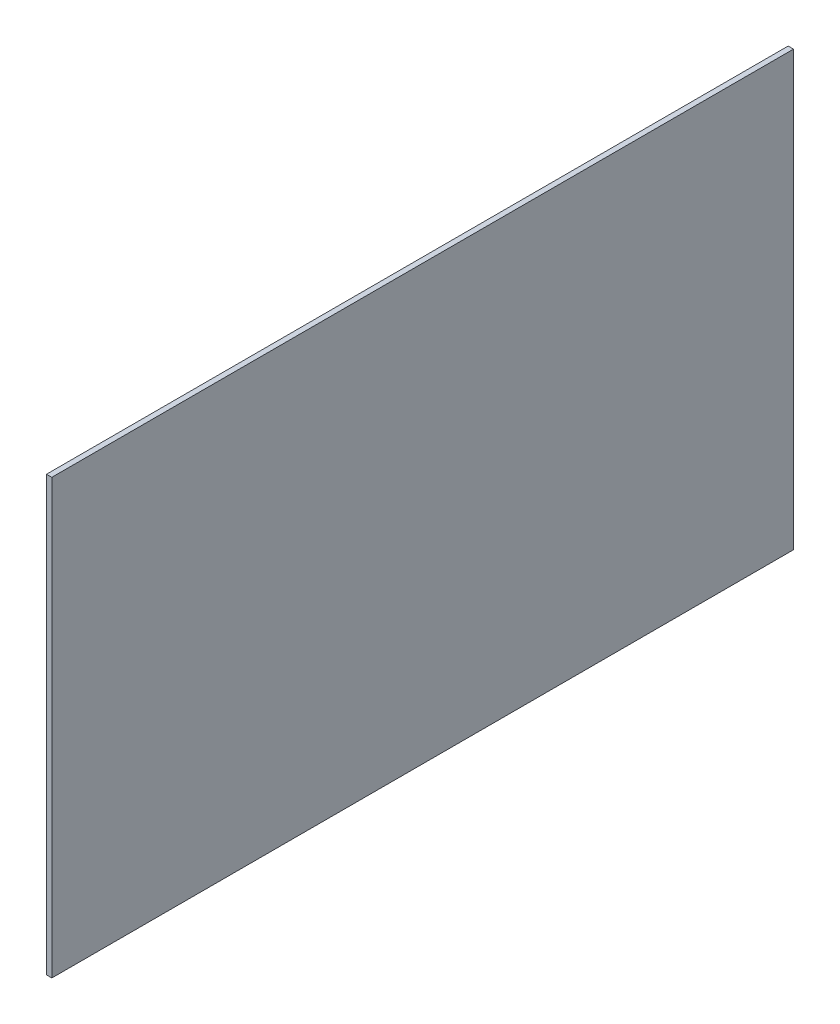
ISO-10303-21;
HEADER;
FILE_DESCRIPTION(('STEP AP214'),'2;1');
FILE_NAME('part.step','',(''),(''),'','','');
FILE_SCHEMA(('AUTOMOTIVE_DESIGN { 1 0 10303 214 1 1 1 1 }'));
ENDSEC;
DATA;
#1=APPLICATION_CONTEXT('core data for automotive mechanical design processes');
#2=APPLICATION_PROTOCOL_DEFINITION('international standard','automotive_design',2000,#1);
#3=PRODUCT_CONTEXT('',#1,'mechanical');
#4=PRODUCT('Part','Part','',(#3));
#5=PRODUCT_RELATED_PRODUCT_CATEGORY('part','',(#4));
#6=PRODUCT_DEFINITION_FORMATION('','',#4);
#7=PRODUCT_DEFINITION_CONTEXT('part definition',#1,'design');
#8=PRODUCT_DEFINITION('design','',#6,#7);
#9=PRODUCT_DEFINITION_SHAPE('','',#8);
#10=(LENGTH_UNIT() NAMED_UNIT(*) SI_UNIT(.MILLI.,.METRE.));
#11=(NAMED_UNIT(*) PLANE_ANGLE_UNIT() SI_UNIT($,.RADIAN.));
#12=(NAMED_UNIT(*) SI_UNIT($,.STERADIAN.) SOLID_ANGLE_UNIT());
#13=UNCERTAINTY_MEASURE_WITH_UNIT(LENGTH_MEASURE(1.E-05),#10,'distance_accuracy_value','');
#14=(GEOMETRIC_REPRESENTATION_CONTEXT(3) GLOBAL_UNCERTAINTY_ASSIGNED_CONTEXT((#13)) GLOBAL_UNIT_ASSIGNED_CONTEXT((#10,
#11,#12)) REPRESENTATION_CONTEXT('',''));
#15=CARTESIAN_POINT('',(0.,0.,0.));
#16=DIRECTION('',(0.,0.,1.));
#17=DIRECTION('',(1.,0.,0.));
#18=AXIS2_PLACEMENT_3D('',#15,#16,#17);
#19=CARTESIAN_POINT('',(16.,1299.,0.));
#20=DIRECTION('',(0.,0.,1.));
#21=DIRECTION('',(0.,-1.,0.));
#22=AXIS2_PLACEMENT_3D('',#19,#20,#21);
#23=PLANE('',#22);
#24=DIRECTION('',(0.,1.,0.));
#25=VECTOR('',#24,1.);
#26=CARTESIAN_POINT('',(0.,1299.,0.));
#27=LINE('',#26,#25);
#28=CARTESIAN_POINT('',(0.,0.,0.));
#29=VERTEX_POINT('',#28);
#30=CARTESIAN_POINT('',(0.,1299.,0.));
#31=VERTEX_POINT('',#30);
#32=EDGE_CURVE('E98',#29,#31,#27,.T.);
#33=ORIENTED_EDGE('',*,*,#32,.T.);
#34=DIRECTION('',(-1.,0.,0.));
#35=VECTOR('',#34,1.);
#36=CARTESIAN_POINT('',(16.,1299.,0.));
#37=LINE('',#36,#35);
#38=CARTESIAN_POINT('',(16.,1299.,0.));
#39=VERTEX_POINT('',#38);
#40=EDGE_CURVE('E11',#39,#31,#37,.T.);
#41=ORIENTED_EDGE('',*,*,#40,.F.);
#42=DIRECTION('',(0.,1.,0.));
#43=VECTOR('',#42,1.);
#44=CARTESIAN_POINT('',(16.,1299.,0.));
#45=LINE('',#44,#43);
#46=CARTESIAN_POINT('',(16.,0.,0.));
#47=VERTEX_POINT('',#46);
#48=EDGE_CURVE('E86',#47,#39,#45,.T.);
#49=ORIENTED_EDGE('',*,*,#48,.F.);
#50=DIRECTION('',(-1.,0.,0.));
#51=VECTOR('',#50,1.);
#52=CARTESIAN_POINT('',(16.,0.,0.));
#53=LINE('',#52,#51);
#54=EDGE_CURVE('E94',#47,#29,#53,.T.);
#55=ORIENTED_EDGE('',*,*,#54,.T.);
#56=EDGE_LOOP('',(#33,#41,#49,#55));
#57=FACE_BOUND('',#56,.T.);
#58=ADVANCED_FACE('F35',(#57),#23,.F.);
#59=CARTESIAN_POINT('',(16.,1299.,0.));
#60=DIRECTION('',(0.,-1.,0.));
#61=DIRECTION('',(0.,0.,-1.));
#62=AXIS2_PLACEMENT_3D('',#59,#60,#61);
#63=PLANE('',#62);
#64=DIRECTION('',(0.,0.,1.));
#65=VECTOR('',#64,1.);
#66=CARTESIAN_POINT('',(0.,1299.,0.));
#67=LINE('',#66,#65);
#68=CARTESIAN_POINT('',(0.,1299.,2222.));
#69=VERTEX_POINT('',#68);
#70=EDGE_CURVE('E90',#31,#69,#67,.T.);
#71=ORIENTED_EDGE('',*,*,#70,.T.);
#72=DIRECTION('',(-1.,0.,0.));
#73=VECTOR('',#72,1.);
#74=CARTESIAN_POINT('',(16.,1299.,2222.));
#75=LINE('',#74,#73);
#76=CARTESIAN_POINT('',(16.,1299.,2222.));
#77=VERTEX_POINT('',#76);
#78=EDGE_CURVE('E43',#77,#69,#75,.T.);
#79=ORIENTED_EDGE('',*,*,#78,.F.);
#80=DIRECTION('',(0.,0.,1.));
#81=VECTOR('',#80,1.);
#82=CARTESIAN_POINT('',(16.,1299.,0.));
#83=LINE('',#82,#81);
#84=EDGE_CURVE('E81',#39,#77,#83,.T.);
#85=ORIENTED_EDGE('',*,*,#84,.F.);
#86=ORIENTED_EDGE('',*,*,#40,.T.);
#87=EDGE_LOOP('',(#71,#79,#85,#86));
#88=FACE_BOUND('',#87,.T.);
#89=ADVANCED_FACE('F89',(#88),#63,.F.);
#90=CARTESIAN_POINT('',(16.,1299.,2222.));
#91=DIRECTION('',(0.,0.,-1.));
#92=DIRECTION('',(0.,1.,0.));
#93=AXIS2_PLACEMENT_3D('',#90,#91,#92);
#94=PLANE('',#93);
#95=DIRECTION('',(0.,-1.,0.));
#96=VECTOR('',#95,1.);
#97=CARTESIAN_POINT('',(0.,1299.,2222.));
#98=LINE('',#97,#96);
#99=CARTESIAN_POINT('',(0.,-2.3121331567902E-13,2222.));
#100=VERTEX_POINT('',#99);
#101=EDGE_CURVE('E68',#69,#100,#98,.T.);
#102=ORIENTED_EDGE('',*,*,#101,.T.);
#103=DIRECTION('',(-1.,0.,0.));
#104=VECTOR('',#103,1.);
#105=CARTESIAN_POINT('',(16.,-2.3121331567902E-13,2222.));
#106=LINE('',#105,#104);
#107=CARTESIAN_POINT('',(16.,-2.3121331567902E-13,2222.));
#108=VERTEX_POINT('',#107);
#109=EDGE_CURVE('E91',#108,#100,#106,.T.);
#110=ORIENTED_EDGE('',*,*,#109,.F.);
#111=DIRECTION('',(0.,-1.,0.));
#112=VECTOR('',#111,1.);
#113=CARTESIAN_POINT('',(16.,1299.,2222.));
#114=LINE('',#113,#112);
#115=EDGE_CURVE('E84',#77,#108,#114,.T.);
#116=ORIENTED_EDGE('',*,*,#115,.F.);
#117=ORIENTED_EDGE('',*,*,#78,.T.);
#118=EDGE_LOOP('',(#102,#110,#116,#117));
#119=FACE_BOUND('',#118,.T.);
#120=ADVANCED_FACE('F92',(#119),#94,.F.);
#121=CARTESIAN_POINT('',(16.,0.,0.));
#122=DIRECTION('',(0.,1.,0.));
#123=DIRECTION('',(0.,0.,1.));
#124=AXIS2_PLACEMENT_3D('',#121,#122,#123);
#125=PLANE('',#124);
#126=DIRECTION('',(0.,0.,-1.));
#127=VECTOR('',#126,1.);
#128=CARTESIAN_POINT('',(0.,0.,0.));
#129=LINE('',#128,#127);
#130=EDGE_CURVE('E74',#100,#29,#129,.T.);
#131=ORIENTED_EDGE('',*,*,#130,.T.);
#132=ORIENTED_EDGE('',*,*,#54,.F.);
#133=DIRECTION('',(0.,0.,-1.));
#134=VECTOR('',#133,1.);
#135=CARTESIAN_POINT('',(16.,0.,0.));
#136=LINE('',#135,#134);
#137=EDGE_CURVE('E51',#108,#47,#136,.T.);
#138=ORIENTED_EDGE('',*,*,#137,.F.);
#139=ORIENTED_EDGE('',*,*,#109,.T.);
#140=EDGE_LOOP('',(#131,#132,#138,#139));
#141=FACE_BOUND('',#140,.T.);
#142=ADVANCED_FACE('F105',(#141),#125,.F.);
#143=CARTESIAN_POINT('',(16.,0.,0.));
#144=DIRECTION('',(-1.,0.,0.));
#145=DIRECTION('',(0.,0.,1.));
#146=AXIS2_PLACEMENT_3D('',#143,#144,#145);
#147=PLANE('',#146);
#148=ORIENTED_EDGE('',*,*,#48,.T.);
#149=ORIENTED_EDGE('',*,*,#84,.T.);
#150=ORIENTED_EDGE('',*,*,#115,.T.);
#151=ORIENTED_EDGE('',*,*,#137,.T.);
#152=EDGE_LOOP('',(#148,#149,#150,#151));
#153=FACE_BOUND('',#152,.T.);
#154=ADVANCED_FACE('F82',(#153),#147,.F.);
#155=CARTESIAN_POINT('',(0.,0.,0.));
#156=DIRECTION('',(-1.,0.,0.));
#157=DIRECTION('',(0.,0.,1.));
#158=AXIS2_PLACEMENT_3D('',#155,#156,#157);
#159=PLANE('',#158);
#160=ORIENTED_EDGE('',*,*,#32,.F.);
#161=ORIENTED_EDGE('',*,*,#130,.F.);
#162=ORIENTED_EDGE('',*,*,#101,.F.);
#163=ORIENTED_EDGE('',*,*,#70,.F.);
#164=EDGE_LOOP('',(#160,#161,#162,#163));
#165=FACE_BOUND('',#164,.T.);
#166=ADVANCED_FACE('F108',(#165),#159,.T.);
#167=CLOSED_SHELL('',(#58,#89,#120,#142,#154,#166));
#168=MANIFOLD_SOLID_BREP('B2',#167);
#169=ADVANCED_BREP_SHAPE_REPRESENTATION('',(#18,#168),#14);
#170=SHAPE_DEFINITION_REPRESENTATION(#9,#169);
ENDSEC;
END-ISO-10303-21;
